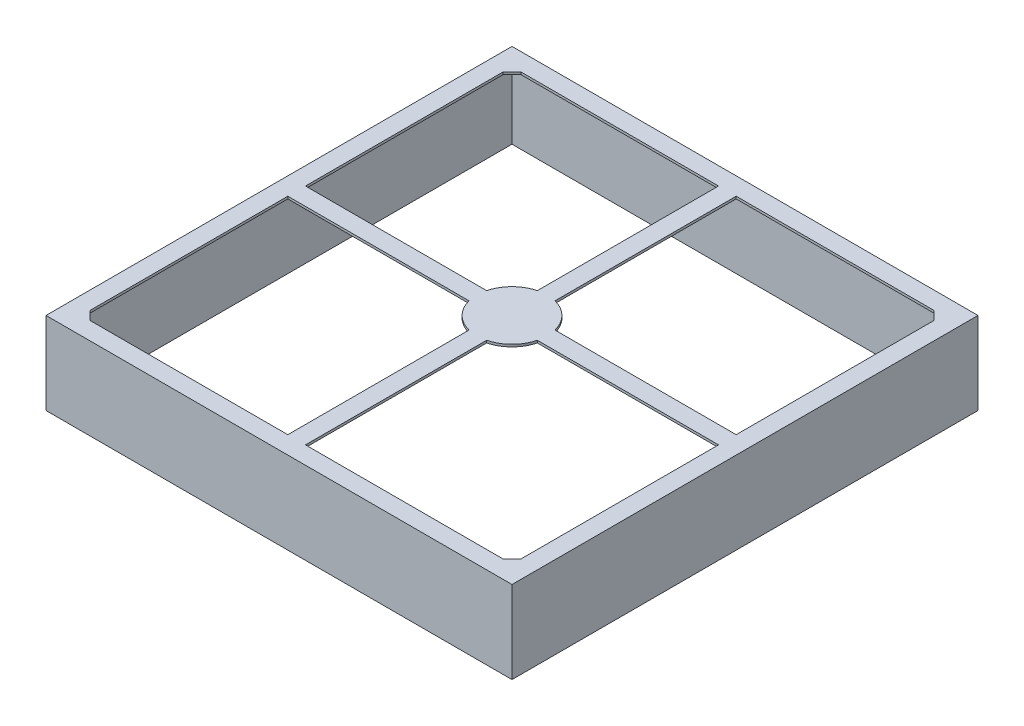
ISO-10303-21;
HEADER;
FILE_DESCRIPTION(('STEP AP214'),'2;1');
FILE_NAME('part.step','',(''),(''),'','','');
FILE_SCHEMA(('AUTOMOTIVE_DESIGN { 1 0 10303 214 1 1 1 1 }'));
ENDSEC;
DATA;
#1=APPLICATION_CONTEXT('core data for automotive mechanical design processes');
#2=APPLICATION_PROTOCOL_DEFINITION('international standard','automotive_design',2000,#1);
#3=PRODUCT_CONTEXT('',#1,'mechanical');
#4=PRODUCT('Part','Part','',(#3));
#5=PRODUCT_RELATED_PRODUCT_CATEGORY('part','',(#4));
#6=PRODUCT_DEFINITION_FORMATION('','',#4);
#7=PRODUCT_DEFINITION_CONTEXT('part definition',#1,'design');
#8=PRODUCT_DEFINITION('design','',#6,#7);
#9=PRODUCT_DEFINITION_SHAPE('','',#8);
#10=(LENGTH_UNIT() NAMED_UNIT(*) SI_UNIT(.MILLI.,.METRE.));
#11=(NAMED_UNIT(*) PLANE_ANGLE_UNIT() SI_UNIT($,.RADIAN.));
#12=(NAMED_UNIT(*) SI_UNIT($,.STERADIAN.) SOLID_ANGLE_UNIT());
#13=UNCERTAINTY_MEASURE_WITH_UNIT(LENGTH_MEASURE(1.E-05),#10,'distance_accuracy_value','');
#14=(GEOMETRIC_REPRESENTATION_CONTEXT(3) GLOBAL_UNCERTAINTY_ASSIGNED_CONTEXT((#13)) GLOBAL_UNIT_ASSIGNED_CONTEXT((#10,
#11,#12)) REPRESENTATION_CONTEXT('',''));
#15=CARTESIAN_POINT('',(0.,0.,0.));
#16=DIRECTION('',(0.,0.,1.));
#17=DIRECTION('',(1.,0.,0.));
#18=AXIS2_PLACEMENT_3D('',#15,#16,#17);
#19=CARTESIAN_POINT('',(19.8,7.,-19.8));
#20=DIRECTION('',(0.,-1.,0.));
#21=DIRECTION('',(0.,0.,-1.));
#22=AXIS2_PLACEMENT_3D('',#19,#20,#21);
#23=PLANE('',#22);
#24=DIRECTION('',(0.,0.,-1.));
#25=VECTOR('',#24,1.);
#26=CARTESIAN_POINT('',(18.3,7.,-0.75));
#27=LINE('',#26,#25);
#28=CARTESIAN_POINT('',(18.3,7.,-0.75));
#29=VERTEX_POINT('',#28);
#30=CARTESIAN_POINT('',(18.3,7.,-17.55));
#31=VERTEX_POINT('',#30);
#32=EDGE_CURVE('E259',#29,#31,#27,.T.);
#33=ORIENTED_EDGE('',*,*,#32,.F.);
#34=DIRECTION('',(1.,0.,0.));
#35=VECTOR('',#34,1.);
#36=CARTESIAN_POINT('',(18.3,7.,-0.75));
#37=LINE('',#36,#35);
#38=CARTESIAN_POINT('',(2.90473750965556,7.,-0.749999999999999));
#39=VERTEX_POINT('',#38);
#40=EDGE_CURVE('E293',#39,#29,#37,.T.);
#41=ORIENTED_EDGE('',*,*,#40,.F.);
#42=CARTESIAN_POINT('',(0.,7.,0.));
#43=DIRECTION('',(0.,-1.,0.));
#44=DIRECTION('',(0.,0.,1.));
#45=AXIS2_PLACEMENT_3D('',#42,#43,#44);
#46=CIRCLE('',#45,3.);
#47=CARTESIAN_POINT('',(0.75,7.,-2.90473750965557));
#48=VERTEX_POINT('',#47);
#49=EDGE_CURVE('E290',#48,#39,#46,.T.);
#50=ORIENTED_EDGE('',*,*,#49,.F.);
#51=DIRECTION('',(0.,0.,1.));
#52=VECTOR('',#51,1.);
#53=CARTESIAN_POINT('',(0.75,7.,-18.3));
#54=LINE('',#53,#52);
#55=CARTESIAN_POINT('',(0.75,7.,-18.3));
#56=VERTEX_POINT('',#55);
#57=EDGE_CURVE('E288',#56,#48,#54,.T.);
#58=ORIENTED_EDGE('',*,*,#57,.F.);
#59=DIRECTION('',(-1.,0.,0.));
#60=VECTOR('',#59,1.);
#61=CARTESIAN_POINT('',(17.55,7.,-18.3));
#62=LINE('',#61,#60);
#63=CARTESIAN_POINT('',(17.55,7.,-18.3));
#64=VERTEX_POINT('',#63);
#65=EDGE_CURVE('E286',#64,#56,#62,.T.);
#66=ORIENTED_EDGE('',*,*,#65,.F.);
#67=DIRECTION('',(-0.707106781186547,0.,-0.707106781186547));
#68=VECTOR('',#67,1.);
#69=CARTESIAN_POINT('',(18.3,7.,-17.55));
#70=LINE('',#69,#68);
#71=EDGE_CURVE('E284',#31,#64,#70,.T.);
#72=ORIENTED_EDGE('',*,*,#71,.F.);
#73=EDGE_LOOP('',(#33,#41,#50,#58,#66,#72));
#74=FACE_BOUND('',#73,.T.);
#75=CARTESIAN_POINT('',(0.,7.,0.));
#76=DIRECTION('',(0.,-1.,0.));
#77=DIRECTION('',(0.,0.,1.));
#78=AXIS2_PLACEMENT_3D('',#75,#76,#77);
#79=CIRCLE('',#78,3.);
#80=CARTESIAN_POINT('',(-0.75,7.,2.90473750965556));
#81=VERTEX_POINT('',#80);
#82=CARTESIAN_POINT('',(-2.90473750965557,7.,0.75));
#83=VERTEX_POINT('',#82);
#84=EDGE_CURVE('E342',#81,#83,#79,.T.);
#85=ORIENTED_EDGE('',*,*,#84,.F.);
#86=DIRECTION('',(0.,0.,-1.));
#87=VECTOR('',#86,1.);
#88=CARTESIAN_POINT('',(-0.75,7.,2.90473750965556));
#89=LINE('',#88,#87);
#90=CARTESIAN_POINT('',(-0.750000000000001,7.,18.3));
#91=VERTEX_POINT('',#90);
#92=EDGE_CURVE('E353',#91,#81,#89,.T.);
#93=ORIENTED_EDGE('',*,*,#92,.F.);
#94=DIRECTION('',(1.,0.,0.));
#95=VECTOR('',#94,1.);
#96=CARTESIAN_POINT('',(-0.75,7.,18.3));
#97=LINE('',#96,#95);
#98=CARTESIAN_POINT('',(-17.55,7.,18.3));
#99=VERTEX_POINT('',#98);
#100=EDGE_CURVE('E350',#99,#91,#97,.T.);
#101=ORIENTED_EDGE('',*,*,#100,.F.);
#102=DIRECTION('',(0.707106781186547,0.,0.707106781186547));
#103=VECTOR('',#102,1.);
#104=CARTESIAN_POINT('',(-17.55,7.,18.3));
#105=LINE('',#104,#103);
#106=CARTESIAN_POINT('',(-18.3,7.,17.55));
#107=VERTEX_POINT('',#106);
#108=EDGE_CURVE('E348',#107,#99,#105,.T.);
#109=ORIENTED_EDGE('',*,*,#108,.F.);
#110=DIRECTION('',(0.,0.,1.));
#111=VECTOR('',#110,1.);
#112=CARTESIAN_POINT('',(-18.3,7.,17.55));
#113=LINE('',#112,#111);
#114=CARTESIAN_POINT('',(-18.3,7.,0.75));
#115=VERTEX_POINT('',#114);
#116=EDGE_CURVE('E346',#115,#107,#113,.T.);
#117=ORIENTED_EDGE('',*,*,#116,.F.);
#118=DIRECTION('',(-1.,0.,0.));
#119=VECTOR('',#118,1.);
#120=CARTESIAN_POINT('',(-2.90473750965557,7.,0.75));
#121=LINE('',#120,#119);
#122=EDGE_CURVE('E344',#83,#115,#121,.T.);
#123=ORIENTED_EDGE('',*,*,#122,.F.);
#124=EDGE_LOOP('',(#85,#93,#101,#109,#117,#123));
#125=FACE_BOUND('',#124,.T.);
#126=DIRECTION('',(0.,0.,-1.));
#127=VECTOR('',#126,1.);
#128=CARTESIAN_POINT('',(19.8,7.,19.8));
#129=LINE('',#128,#127);
#130=CARTESIAN_POINT('',(19.8,7.,19.8));
#131=VERTEX_POINT('',#130);
#132=CARTESIAN_POINT('',(19.8,7.,-19.8));
#133=VERTEX_POINT('',#132);
#134=EDGE_CURVE('E405',#131,#133,#129,.T.);
#135=ORIENTED_EDGE('',*,*,#134,.T.);
#136=DIRECTION('',(-1.,0.,0.));
#137=VECTOR('',#136,1.);
#138=CARTESIAN_POINT('',(-19.8,7.,-19.8));
#139=LINE('',#138,#137);
#140=CARTESIAN_POINT('',(-19.8,7.,-19.8));
#141=VERTEX_POINT('',#140);
#142=EDGE_CURVE('E408',#133,#141,#139,.T.);
#143=ORIENTED_EDGE('',*,*,#142,.T.);
#144=DIRECTION('',(0.,0.,1.));
#145=VECTOR('',#144,1.);
#146=CARTESIAN_POINT('',(-19.8,7.,19.8));
#147=LINE('',#146,#145);
#148=CARTESIAN_POINT('',(-19.8,7.,19.8));
#149=VERTEX_POINT('',#148);
#150=EDGE_CURVE('E411',#141,#149,#147,.T.);
#151=ORIENTED_EDGE('',*,*,#150,.T.);
#152=DIRECTION('',(1.,0.,0.));
#153=VECTOR('',#152,1.);
#154=CARTESIAN_POINT('',(-19.8,7.,19.8));
#155=LINE('',#154,#153);
#156=EDGE_CURVE('E413',#149,#131,#155,.T.);
#157=ORIENTED_EDGE('',*,*,#156,.T.);
#158=EDGE_LOOP('',(#135,#143,#151,#157));
#159=FACE_BOUND('',#158,.T.);
#160=DIRECTION('',(-1.,0.,0.));
#161=VECTOR('',#160,1.);
#162=CARTESIAN_POINT('',(-0.75,7.,-18.3));
#163=LINE('',#162,#161);
#164=CARTESIAN_POINT('',(-0.75,7.,-18.3));
#165=VERTEX_POINT('',#164);
#166=CARTESIAN_POINT('',(-17.55,7.,-18.3));
#167=VERTEX_POINT('',#166);
#168=EDGE_CURVE('E312',#165,#167,#163,.T.);
#169=ORIENTED_EDGE('',*,*,#168,.F.);
#170=DIRECTION('',(0.,0.,-1.));
#171=VECTOR('',#170,1.);
#172=CARTESIAN_POINT('',(-0.75,7.,-18.3));
#173=LINE('',#172,#171);
#174=CARTESIAN_POINT('',(-0.749999999999998,7.,-2.90473750965557));
#175=VERTEX_POINT('',#174);
#176=EDGE_CURVE('E323',#175,#165,#173,.T.);
#177=ORIENTED_EDGE('',*,*,#176,.F.);
#178=CARTESIAN_POINT('',(0.,7.,0.));
#179=DIRECTION('',(0.,-1.,0.));
#180=DIRECTION('',(0.,0.,1.));
#181=AXIS2_PLACEMENT_3D('',#178,#179,#180);
#182=CIRCLE('',#181,3.);
#183=CARTESIAN_POINT('',(-2.90473750965557,7.,-0.750000000000002));
#184=VERTEX_POINT('',#183);
#185=EDGE_CURVE('E320',#184,#175,#182,.T.);
#186=ORIENTED_EDGE('',*,*,#185,.F.);
#187=DIRECTION('',(1.,0.,0.));
#188=VECTOR('',#187,1.);
#189=CARTESIAN_POINT('',(-2.90473750965557,7.,-0.75));
#190=LINE('',#189,#188);
#191=CARTESIAN_POINT('',(-18.3,7.,-0.75));
#192=VERTEX_POINT('',#191);
#193=EDGE_CURVE('E318',#192,#184,#190,.T.);
#194=ORIENTED_EDGE('',*,*,#193,.F.);
#195=DIRECTION('',(0.,0.,1.));
#196=VECTOR('',#195,1.);
#197=CARTESIAN_POINT('',(-18.3,7.,-0.75));
#198=LINE('',#197,#196);
#199=CARTESIAN_POINT('',(-18.3,7.,-17.55));
#200=VERTEX_POINT('',#199);
#201=EDGE_CURVE('E316',#200,#192,#198,.T.);
#202=ORIENTED_EDGE('',*,*,#201,.F.);
#203=DIRECTION('',(-0.707106781186547,0.,0.707106781186547));
#204=VECTOR('',#203,1.);
#205=CARTESIAN_POINT('',(-17.55,7.,-18.3));
#206=LINE('',#205,#204);
#207=EDGE_CURVE('E314',#167,#200,#206,.T.);
#208=ORIENTED_EDGE('',*,*,#207,.F.);
#209=EDGE_LOOP('',(#169,#177,#186,#194,#202,#208));
#210=FACE_BOUND('',#209,.T.);
#211=DIRECTION('',(0.,0.,1.));
#212=VECTOR('',#211,1.);
#213=CARTESIAN_POINT('',(0.75,7.,2.90473750965556));
#214=LINE('',#213,#212);
#215=CARTESIAN_POINT('',(0.75,7.,2.90473750965556));
#216=VERTEX_POINT('',#215);
#217=CARTESIAN_POINT('',(0.75,7.,18.3));
#218=VERTEX_POINT('',#217);
#219=EDGE_CURVE('E245',#216,#218,#214,.T.);
#220=ORIENTED_EDGE('',*,*,#219,.F.);
#221=CARTESIAN_POINT('',(0.,7.,0.));
#222=DIRECTION('',(0.,-1.,0.));
#223=DIRECTION('',(0.,0.,1.));
#224=AXIS2_PLACEMENT_3D('',#221,#222,#223);
#225=CIRCLE('',#224,3.);
#226=CARTESIAN_POINT('',(2.90473750965556,7.,0.749999999999999));
#227=VERTEX_POINT('',#226);
#228=EDGE_CURVE('E272',#227,#216,#225,.T.);
#229=ORIENTED_EDGE('',*,*,#228,.F.);
#230=DIRECTION('',(-1.,0.,0.));
#231=VECTOR('',#230,1.);
#232=CARTESIAN_POINT('',(18.3,7.,0.75));
#233=LINE('',#232,#231);
#234=CARTESIAN_POINT('',(18.3,7.,0.75));
#235=VERTEX_POINT('',#234);
#236=EDGE_CURVE('E270',#235,#227,#233,.T.);
#237=ORIENTED_EDGE('',*,*,#236,.F.);
#238=DIRECTION('',(0.,0.,-1.));
#239=VECTOR('',#238,1.);
#240=CARTESIAN_POINT('',(18.3,7.,17.55));
#241=LINE('',#240,#239);
#242=CARTESIAN_POINT('',(18.3,7.,17.55));
#243=VERTEX_POINT('',#242);
#244=EDGE_CURVE('E266',#243,#235,#241,.T.);
#245=ORIENTED_EDGE('',*,*,#244,.F.);
#246=DIRECTION('',(0.707106781186547,0.,-0.707106781186547));
#247=VECTOR('',#246,1.);
#248=CARTESIAN_POINT('',(17.55,7.,18.3));
#249=LINE('',#248,#247);
#250=CARTESIAN_POINT('',(17.55,7.,18.3));
#251=VERTEX_POINT('',#250);
#252=EDGE_CURVE('E264',#251,#243,#249,.T.);
#253=ORIENTED_EDGE('',*,*,#252,.F.);
#254=DIRECTION('',(1.,0.,0.));
#255=VECTOR('',#254,1.);
#256=CARTESIAN_POINT('',(17.55,7.,18.3));
#257=LINE('',#256,#255);
#258=EDGE_CURVE('E252',#218,#251,#257,.T.);
#259=ORIENTED_EDGE('',*,*,#258,.F.);
#260=EDGE_LOOP('',(#220,#229,#237,#245,#253,#259));
#261=FACE_BOUND('',#260,.T.);
#262=ADVANCED_FACE('F37',(#74,#125,#159,#210,#261),#23,.F.);
#263=CARTESIAN_POINT('',(19.8,6.8,-19.8));
#264=DIRECTION('',(0.,-1.,0.));
#265=DIRECTION('',(0.,0.,-1.));
#266=AXIS2_PLACEMENT_3D('',#263,#264,#265);
#267=PLANE('',#266);
#268=DIRECTION('',(1.,0.,0.));
#269=VECTOR('',#268,1.);
#270=CARTESIAN_POINT('',(19.8,6.8,-0.750000000000001));
#271=LINE('',#270,#269);
#272=CARTESIAN_POINT('',(2.90473750965556,6.8,-0.749999999999999));
#273=VERTEX_POINT('',#272);
#274=CARTESIAN_POINT('',(18.3,6.8,-0.750000000000001));
#275=VERTEX_POINT('',#274);
#276=EDGE_CURVE('E471',#273,#275,#271,.T.);
#277=ORIENTED_EDGE('',*,*,#276,.T.);
#278=DIRECTION('',(0.,0.,-1.));
#279=VECTOR('',#278,1.);
#280=CARTESIAN_POINT('',(18.3,6.8,-19.8));
#281=LINE('',#280,#279);
#282=CARTESIAN_POINT('',(18.3,6.8,-17.55));
#283=VERTEX_POINT('',#282);
#284=EDGE_CURVE('E486',#275,#283,#281,.T.);
#285=ORIENTED_EDGE('',*,*,#284,.T.);
#286=DIRECTION('',(-0.707106781186548,0.,-0.707106781186548));
#287=VECTOR('',#286,1.);
#288=CARTESIAN_POINT('',(17.925,6.8,-17.925));
#289=LINE('',#288,#287);
#290=CARTESIAN_POINT('',(17.55,6.8,-18.3));
#291=VERTEX_POINT('',#290);
#292=EDGE_CURVE('E483',#283,#291,#289,.T.);
#293=ORIENTED_EDGE('',*,*,#292,.T.);
#294=DIRECTION('',(-1.,0.,0.));
#295=VECTOR('',#294,1.);
#296=CARTESIAN_POINT('',(19.8,6.8,-18.3));
#297=LINE('',#296,#295);
#298=CARTESIAN_POINT('',(0.75,6.8,-18.3));
#299=VERTEX_POINT('',#298);
#300=EDGE_CURVE('E480',#291,#299,#297,.T.);
#301=ORIENTED_EDGE('',*,*,#300,.T.);
#302=DIRECTION('',(0.,0.,1.));
#303=VECTOR('',#302,1.);
#304=CARTESIAN_POINT('',(0.750000000000001,6.8,-19.8));
#305=LINE('',#304,#303);
#306=CARTESIAN_POINT('',(0.75,6.8,-2.90473750965557));
#307=VERTEX_POINT('',#306);
#308=EDGE_CURVE('E477',#299,#307,#305,.T.);
#309=ORIENTED_EDGE('',*,*,#308,.T.);
#310=CARTESIAN_POINT('',(0.,6.8,0.));
#311=DIRECTION('',(0.,-1.,0.));
#312=DIRECTION('',(0.,0.,-1.));
#313=AXIS2_PLACEMENT_3D('',#310,#311,#312);
#314=CIRCLE('',#313,3.);
#315=EDGE_CURVE('E474',#307,#273,#314,.T.);
#316=ORIENTED_EDGE('',*,*,#315,.T.);
#317=EDGE_LOOP('',(#277,#285,#293,#301,#309,#316));
#318=FACE_BOUND('',#317,.T.);
#319=DIRECTION('',(0.,0.,-1.));
#320=VECTOR('',#319,1.);
#321=CARTESIAN_POINT('',(-0.750000000000001,6.8,-19.8));
#322=LINE('',#321,#320);
#323=CARTESIAN_POINT('',(-0.75,6.8,18.3));
#324=VERTEX_POINT('',#323);
#325=CARTESIAN_POINT('',(-0.750000000000001,6.8,2.90473750965556));
#326=VERTEX_POINT('',#325);
#327=EDGE_CURVE('E435',#324,#326,#322,.T.);
#328=ORIENTED_EDGE('',*,*,#327,.T.);
#329=CARTESIAN_POINT('',(0.,6.8,0.));
#330=DIRECTION('',(0.,-1.,0.));
#331=DIRECTION('',(0.,0.,-1.));
#332=AXIS2_PLACEMENT_3D('',#329,#330,#331);
#333=CIRCLE('',#332,3.);
#334=CARTESIAN_POINT('',(-2.90473750965557,6.8,0.75));
#335=VERTEX_POINT('',#334);
#336=EDGE_CURVE('E450',#326,#335,#333,.T.);
#337=ORIENTED_EDGE('',*,*,#336,.T.);
#338=DIRECTION('',(-1.,0.,0.));
#339=VECTOR('',#338,1.);
#340=CARTESIAN_POINT('',(19.8,6.8,0.750000000000001));
#341=LINE('',#340,#339);
#342=CARTESIAN_POINT('',(-18.3,6.8,0.75));
#343=VERTEX_POINT('',#342);
#344=EDGE_CURVE('E447',#335,#343,#341,.T.);
#345=ORIENTED_EDGE('',*,*,#344,.T.);
#346=DIRECTION('',(0.,0.,1.));
#347=VECTOR('',#346,1.);
#348=CARTESIAN_POINT('',(-18.3,6.8,-19.8));
#349=LINE('',#348,#347);
#350=CARTESIAN_POINT('',(-18.3,6.8,17.55));
#351=VERTEX_POINT('',#350);
#352=EDGE_CURVE('E444',#343,#351,#349,.T.);
#353=ORIENTED_EDGE('',*,*,#352,.T.);
#354=DIRECTION('',(0.707106781186548,0.,0.707106781186548));
#355=VECTOR('',#354,1.);
#356=CARTESIAN_POINT('',(-17.925,6.8,17.925));
#357=LINE('',#356,#355);
#358=CARTESIAN_POINT('',(-17.55,6.8,18.3));
#359=VERTEX_POINT('',#358);
#360=EDGE_CURVE('E441',#351,#359,#357,.T.);
#361=ORIENTED_EDGE('',*,*,#360,.T.);
#362=DIRECTION('',(1.,0.,0.));
#363=VECTOR('',#362,1.);
#364=CARTESIAN_POINT('',(19.8,6.8,18.3));
#365=LINE('',#364,#363);
#366=EDGE_CURVE('E438',#359,#324,#365,.T.);
#367=ORIENTED_EDGE('',*,*,#366,.T.);
#368=EDGE_LOOP('',(#328,#337,#345,#353,#361,#367));
#369=FACE_BOUND('',#368,.T.);
#370=DIRECTION('',(0.,0.,-1.));
#371=VECTOR('',#370,1.);
#372=CARTESIAN_POINT('',(19.6,6.8,-19.8));
#373=LINE('',#372,#371);
#374=CARTESIAN_POINT('',(19.6,6.8,19.6));
#375=VERTEX_POINT('',#374);
#376=CARTESIAN_POINT('',(19.6,6.8,-19.6));
#377=VERTEX_POINT('',#376);
#378=EDGE_CURVE('E378',#375,#377,#373,.T.);
#379=ORIENTED_EDGE('',*,*,#378,.F.);
#380=DIRECTION('',(1.,0.,0.));
#381=VECTOR('',#380,1.);
#382=CARTESIAN_POINT('',(19.8,6.8,19.6));
#383=LINE('',#382,#381);
#384=CARTESIAN_POINT('',(-19.6,6.8,19.6));
#385=VERTEX_POINT('',#384);
#386=EDGE_CURVE('E386',#385,#375,#383,.T.);
#387=ORIENTED_EDGE('',*,*,#386,.F.);
#388=DIRECTION('',(0.,0.,1.));
#389=VECTOR('',#388,1.);
#390=CARTESIAN_POINT('',(-19.6,6.8,-19.8));
#391=LINE('',#390,#389);
#392=CARTESIAN_POINT('',(-19.6,6.8,-19.6));
#393=VERTEX_POINT('',#392);
#394=EDGE_CURVE('E390',#393,#385,#391,.T.);
#395=ORIENTED_EDGE('',*,*,#394,.F.);
#396=DIRECTION('',(-1.,0.,0.));
#397=VECTOR('',#396,1.);
#398=CARTESIAN_POINT('',(19.8,6.8,-19.6));
#399=LINE('',#398,#397);
#400=EDGE_CURVE('E381',#377,#393,#399,.T.);
#401=ORIENTED_EDGE('',*,*,#400,.F.);
#402=EDGE_LOOP('',(#379,#387,#395,#401));
#403=FACE_BOUND('',#402,.T.);
#404=DIRECTION('',(0.,0.,-1.));
#405=VECTOR('',#404,1.);
#406=CARTESIAN_POINT('',(-0.750000000000001,6.8,-19.8));
#407=LINE('',#406,#405);
#408=CARTESIAN_POINT('',(-0.749999999999998,6.8,-2.90473750965557));
#409=VERTEX_POINT('',#408);
#410=CARTESIAN_POINT('',(-0.75,6.8,-18.3));
#411=VERTEX_POINT('',#410);
#412=EDGE_CURVE('E453',#409,#411,#407,.T.);
#413=ORIENTED_EDGE('',*,*,#412,.T.);
#414=DIRECTION('',(-1.,0.,0.));
#415=VECTOR('',#414,1.);
#416=CARTESIAN_POINT('',(19.8,6.8,-18.3));
#417=LINE('',#416,#415);
#418=CARTESIAN_POINT('',(-17.55,6.8,-18.3));
#419=VERTEX_POINT('',#418);
#420=EDGE_CURVE('E468',#411,#419,#417,.T.);
#421=ORIENTED_EDGE('',*,*,#420,.T.);
#422=DIRECTION('',(-0.707106781186548,0.,0.707106781186548));
#423=VECTOR('',#422,1.);
#424=CARTESIAN_POINT('',(1.87499999999999,6.8,-37.725));
#425=LINE('',#424,#423);
#426=CARTESIAN_POINT('',(-18.3,6.8,-17.55));
#427=VERTEX_POINT('',#426);
#428=EDGE_CURVE('E465',#419,#427,#425,.T.);
#429=ORIENTED_EDGE('',*,*,#428,.T.);
#430=DIRECTION('',(0.,0.,1.));
#431=VECTOR('',#430,1.);
#432=CARTESIAN_POINT('',(-18.3,6.8,-19.8));
#433=LINE('',#432,#431);
#434=CARTESIAN_POINT('',(-18.3,6.8,-0.75));
#435=VERTEX_POINT('',#434);
#436=EDGE_CURVE('E462',#427,#435,#433,.T.);
#437=ORIENTED_EDGE('',*,*,#436,.T.);
#438=DIRECTION('',(1.,0.,0.));
#439=VECTOR('',#438,1.);
#440=CARTESIAN_POINT('',(19.8,6.8,-0.750000000000001));
#441=LINE('',#440,#439);
#442=CARTESIAN_POINT('',(-2.90473750965557,6.8,-0.750000000000002));
#443=VERTEX_POINT('',#442);
#444=EDGE_CURVE('E459',#435,#443,#441,.T.);
#445=ORIENTED_EDGE('',*,*,#444,.T.);
#446=CARTESIAN_POINT('',(0.,6.8,0.));
#447=DIRECTION('',(0.,-1.,0.));
#448=DIRECTION('',(0.,0.,-1.));
#449=AXIS2_PLACEMENT_3D('',#446,#447,#448);
#450=CIRCLE('',#449,3.);
#451=EDGE_CURVE('E456',#443,#409,#450,.T.);
#452=ORIENTED_EDGE('',*,*,#451,.T.);
#453=EDGE_LOOP('',(#413,#421,#429,#437,#445,#452));
#454=FACE_BOUND('',#453,.T.);
#455=CARTESIAN_POINT('',(0.,6.8,0.));
#456=DIRECTION('',(0.,-1.,0.));
#457=DIRECTION('',(0.,0.,-1.));
#458=AXIS2_PLACEMENT_3D('',#455,#456,#457);
#459=CIRCLE('',#458,3.);
#460=CARTESIAN_POINT('',(2.90473750965556,6.8,0.749999999999999));
#461=VERTEX_POINT('',#460);
#462=CARTESIAN_POINT('',(0.75,6.8,2.90473750965556));
#463=VERTEX_POINT('',#462);
#464=EDGE_CURVE('E489',#461,#463,#459,.T.);
#465=ORIENTED_EDGE('',*,*,#464,.T.);
#466=DIRECTION('',(0.,0.,1.));
#467=VECTOR('',#466,1.);
#468=CARTESIAN_POINT('',(0.750000000000001,6.8,-19.8));
#469=LINE('',#468,#467);
#470=CARTESIAN_POINT('',(0.75,6.8,18.3));
#471=VERTEX_POINT('',#470);
#472=EDGE_CURVE('E11',#463,#471,#469,.T.);
#473=ORIENTED_EDGE('',*,*,#472,.T.);
#474=DIRECTION('',(1.,0.,0.));
#475=VECTOR('',#474,1.);
#476=CARTESIAN_POINT('',(19.8,6.8,18.3));
#477=LINE('',#476,#475);
#478=CARTESIAN_POINT('',(17.55,6.8,18.3));
#479=VERTEX_POINT('',#478);
#480=EDGE_CURVE('E45',#471,#479,#477,.T.);
#481=ORIENTED_EDGE('',*,*,#480,.T.);
#482=DIRECTION('',(0.707106781186548,0.,-0.707106781186548));
#483=VECTOR('',#482,1.);
#484=CARTESIAN_POINT('',(37.725,6.8,-1.875));
#485=LINE('',#484,#483);
#486=CARTESIAN_POINT('',(18.3,6.8,17.55));
#487=VERTEX_POINT('',#486);
#488=EDGE_CURVE('E498',#479,#487,#485,.T.);
#489=ORIENTED_EDGE('',*,*,#488,.T.);
#490=DIRECTION('',(0.,0.,-1.));
#491=VECTOR('',#490,1.);
#492=CARTESIAN_POINT('',(18.3,6.8,-19.8));
#493=LINE('',#492,#491);
#494=CARTESIAN_POINT('',(18.3,6.8,0.75));
#495=VERTEX_POINT('',#494);
#496=EDGE_CURVE('E495',#487,#495,#493,.T.);
#497=ORIENTED_EDGE('',*,*,#496,.T.);
#498=DIRECTION('',(-1.,0.,0.));
#499=VECTOR('',#498,1.);
#500=CARTESIAN_POINT('',(19.8,6.8,0.750000000000001));
#501=LINE('',#500,#499);
#502=EDGE_CURVE('E492',#495,#461,#501,.T.);
#503=ORIENTED_EDGE('',*,*,#502,.T.);
#504=EDGE_LOOP('',(#465,#473,#481,#489,#497,#503));
#505=FACE_BOUND('',#504,.T.);
#506=ADVANCED_FACE('F501',(#318,#369,#403,#454,#505),#267,.T.);
#507=CARTESIAN_POINT('',(19.8,0.,-19.8));
#508=DIRECTION('',(0.,-1.,0.));
#509=DIRECTION('',(0.,0.,-1.));
#510=AXIS2_PLACEMENT_3D('',#507,#508,#509);
#511=PLANE('',#510);
#512=DIRECTION('',(0.,0.,-1.));
#513=VECTOR('',#512,1.);
#514=CARTESIAN_POINT('',(19.8,0.,19.8));
#515=LINE('',#514,#513);
#516=CARTESIAN_POINT('',(19.8,0.,19.8));
#517=VERTEX_POINT('',#516);
#518=CARTESIAN_POINT('',(19.8,0.,-19.8));
#519=VERTEX_POINT('',#518);
#520=EDGE_CURVE('E376',#517,#519,#515,.T.);
#521=ORIENTED_EDGE('',*,*,#520,.F.);
#522=DIRECTION('',(1.,0.,0.));
#523=VECTOR('',#522,1.);
#524=CARTESIAN_POINT('',(-19.8,0.,19.8));
#525=LINE('',#524,#523);
#526=CARTESIAN_POINT('',(-19.8,0.,19.8));
#527=VERTEX_POINT('',#526);
#528=EDGE_CURVE('E409',#527,#517,#525,.T.);
#529=ORIENTED_EDGE('',*,*,#528,.F.);
#530=DIRECTION('',(0.,0.,1.));
#531=VECTOR('',#530,1.);
#532=CARTESIAN_POINT('',(-19.8,0.,19.8));
#533=LINE('',#532,#531);
#534=CARTESIAN_POINT('',(-19.8,0.,-19.8));
#535=VERTEX_POINT('',#534);
#536=EDGE_CURVE('E421',#535,#527,#533,.T.);
#537=ORIENTED_EDGE('',*,*,#536,.F.);
#538=DIRECTION('',(-1.,0.,0.));
#539=VECTOR('',#538,1.);
#540=CARTESIAN_POINT('',(-19.8,0.,-19.8));
#541=LINE('',#540,#539);
#542=EDGE_CURVE('E419',#519,#535,#541,.T.);
#543=ORIENTED_EDGE('',*,*,#542,.F.);
#544=EDGE_LOOP('',(#521,#529,#537,#543));
#545=FACE_BOUND('',#544,.T.);
#546=DIRECTION('',(1.,0.,0.));
#547=VECTOR('',#546,1.);
#548=CARTESIAN_POINT('',(19.8,0.,19.6));
#549=LINE('',#548,#547);
#550=CARTESIAN_POINT('',(-19.6,0.,19.6));
#551=VERTEX_POINT('',#550);
#552=CARTESIAN_POINT('',(19.6,0.,19.6));
#553=VERTEX_POINT('',#552);
#554=EDGE_CURVE('E382',#551,#553,#549,.T.);
#555=ORIENTED_EDGE('',*,*,#554,.T.);
#556=DIRECTION('',(0.,0.,-1.));
#557=VECTOR('',#556,1.);
#558=CARTESIAN_POINT('',(19.6,0.,-19.8));
#559=LINE('',#558,#557);
#560=CARTESIAN_POINT('',(19.6,0.,-19.6));
#561=VERTEX_POINT('',#560);
#562=EDGE_CURVE('E372',#553,#561,#559,.T.);
#563=ORIENTED_EDGE('',*,*,#562,.T.);
#564=DIRECTION('',(-1.,0.,0.));
#565=VECTOR('',#564,1.);
#566=CARTESIAN_POINT('',(19.8,0.,-19.6));
#567=LINE('',#566,#565);
#568=CARTESIAN_POINT('',(-19.6,0.,-19.6));
#569=VERTEX_POINT('',#568);
#570=EDGE_CURVE('E397',#561,#569,#567,.T.);
#571=ORIENTED_EDGE('',*,*,#570,.T.);
#572=DIRECTION('',(0.,0.,1.));
#573=VECTOR('',#572,1.);
#574=CARTESIAN_POINT('',(-19.6,0.,-19.8));
#575=LINE('',#574,#573);
#576=EDGE_CURVE('E400',#569,#551,#575,.T.);
#577=ORIENTED_EDGE('',*,*,#576,.T.);
#578=EDGE_LOOP('',(#555,#563,#571,#577));
#579=FACE_BOUND('',#578,.T.);
#580=ADVANCED_FACE('F526',(#545,#579),#511,.T.);
#581=CARTESIAN_POINT('',(19.8,7.,19.8));
#582=DIRECTION('',(-1.,0.,0.));
#583=DIRECTION('',(0.,0.,1.));
#584=AXIS2_PLACEMENT_3D('',#581,#582,#583);
#585=PLANE('',#584);
#586=ORIENTED_EDGE('',*,*,#520,.T.);
#587=DIRECTION('',(0.,-1.,0.));
#588=VECTOR('',#587,1.);
#589=CARTESIAN_POINT('',(19.8,7.,-19.8));
#590=LINE('',#589,#588);
#591=EDGE_CURVE('E432',#133,#519,#590,.T.);
#592=ORIENTED_EDGE('',*,*,#591,.F.);
#593=ORIENTED_EDGE('',*,*,#134,.F.);
#594=DIRECTION('',(0.,-1.,0.));
#595=VECTOR('',#594,1.);
#596=CARTESIAN_POINT('',(19.8,7.,19.8));
#597=LINE('',#596,#595);
#598=EDGE_CURVE('E415',#131,#517,#597,.T.);
#599=ORIENTED_EDGE('',*,*,#598,.T.);
#600=EDGE_LOOP('',(#586,#592,#593,#599));
#601=FACE_BOUND('',#600,.T.);
#602=ADVANCED_FACE('F39',(#601),#585,.F.);
#603=CARTESIAN_POINT('',(-19.8,7.,-19.8));
#604=DIRECTION('',(0.,0.,1.));
#605=DIRECTION('',(1.,0.,0.));
#606=AXIS2_PLACEMENT_3D('',#603,#604,#605);
#607=PLANE('',#606);
#608=ORIENTED_EDGE('',*,*,#542,.T.);
#609=DIRECTION('',(0.,-1.,0.));
#610=VECTOR('',#609,1.);
#611=CARTESIAN_POINT('',(-19.8,7.,-19.8));
#612=LINE('',#611,#610);
#613=EDGE_CURVE('E429',#141,#535,#612,.T.);
#614=ORIENTED_EDGE('',*,*,#613,.F.);
#615=ORIENTED_EDGE('',*,*,#142,.F.);
#616=ORIENTED_EDGE('',*,*,#591,.T.);
#617=EDGE_LOOP('',(#608,#614,#615,#616));
#618=FACE_BOUND('',#617,.T.);
#619=ADVANCED_FACE('F543',(#618),#607,.F.);
#620=CARTESIAN_POINT('',(-19.8,7.,19.8));
#621=DIRECTION('',(1.,0.,0.));
#622=DIRECTION('',(0.,0.,-1.));
#623=AXIS2_PLACEMENT_3D('',#620,#621,#622);
#624=PLANE('',#623);
#625=ORIENTED_EDGE('',*,*,#536,.T.);
#626=DIRECTION('',(0.,-1.,0.));
#627=VECTOR('',#626,1.);
#628=CARTESIAN_POINT('',(-19.8,7.,19.8));
#629=LINE('',#628,#627);
#630=EDGE_CURVE('E426',#149,#527,#629,.T.);
#631=ORIENTED_EDGE('',*,*,#630,.F.);
#632=ORIENTED_EDGE('',*,*,#150,.F.);
#633=ORIENTED_EDGE('',*,*,#613,.T.);
#634=EDGE_LOOP('',(#625,#631,#632,#633));
#635=FACE_BOUND('',#634,.T.);
#636=ADVANCED_FACE('F540',(#635),#624,.F.);
#637=CARTESIAN_POINT('',(-19.8,7.,19.8));
#638=DIRECTION('',(0.,0.,-1.));
#639=DIRECTION('',(-1.,0.,0.));
#640=AXIS2_PLACEMENT_3D('',#637,#638,#639);
#641=PLANE('',#640);
#642=ORIENTED_EDGE('',*,*,#528,.T.);
#643=ORIENTED_EDGE('',*,*,#598,.F.);
#644=ORIENTED_EDGE('',*,*,#156,.F.);
#645=ORIENTED_EDGE('',*,*,#630,.T.);
#646=EDGE_LOOP('',(#642,#643,#644,#645));
#647=FACE_BOUND('',#646,.T.);
#648=ADVANCED_FACE('F536',(#647),#641,.F.);
#649=CARTESIAN_POINT('',(19.6,7.,19.8));
#650=DIRECTION('',(-1.,0.,0.));
#651=DIRECTION('',(0.,0.,1.));
#652=AXIS2_PLACEMENT_3D('',#649,#650,#651);
#653=PLANE('',#652);
#654=ORIENTED_EDGE('',*,*,#562,.F.);
#655=DIRECTION('',(0.,-1.,0.));
#656=VECTOR('',#655,1.);
#657=CARTESIAN_POINT('',(19.6,7.,19.6));
#658=LINE('',#657,#656);
#659=EDGE_CURVE('E383',#375,#553,#658,.T.);
#660=ORIENTED_EDGE('',*,*,#659,.F.);
#661=ORIENTED_EDGE('',*,*,#378,.T.);
#662=DIRECTION('',(0.,-1.,0.));
#663=VECTOR('',#662,1.);
#664=CARTESIAN_POINT('',(19.6,7.,-19.6));
#665=LINE('',#664,#663);
#666=EDGE_CURVE('E373',#377,#561,#665,.T.);
#667=ORIENTED_EDGE('',*,*,#666,.T.);
#668=EDGE_LOOP('',(#654,#660,#661,#667));
#669=FACE_BOUND('',#668,.T.);
#670=ADVANCED_FACE('F539',(#669),#653,.T.);
#671=CARTESIAN_POINT('',(-19.8,7.,-19.6));
#672=DIRECTION('',(0.,0.,1.));
#673=DIRECTION('',(1.,0.,0.));
#674=AXIS2_PLACEMENT_3D('',#671,#672,#673);
#675=PLANE('',#674);
#676=ORIENTED_EDGE('',*,*,#570,.F.);
#677=ORIENTED_EDGE('',*,*,#666,.F.);
#678=ORIENTED_EDGE('',*,*,#400,.T.);
#679=DIRECTION('',(0.,-1.,0.));
#680=VECTOR('',#679,1.);
#681=CARTESIAN_POINT('',(-19.6,7.,-19.6));
#682=LINE('',#681,#680);
#683=EDGE_CURVE('E377',#393,#569,#682,.T.);
#684=ORIENTED_EDGE('',*,*,#683,.T.);
#685=EDGE_LOOP('',(#676,#677,#678,#684));
#686=FACE_BOUND('',#685,.T.);
#687=ADVANCED_FACE('F628',(#686),#675,.T.);
#688=CARTESIAN_POINT('',(-19.6,7.,19.8));
#689=DIRECTION('',(1.,0.,0.));
#690=DIRECTION('',(0.,0.,-1.));
#691=AXIS2_PLACEMENT_3D('',#688,#689,#690);
#692=PLANE('',#691);
#693=ORIENTED_EDGE('',*,*,#576,.F.);
#694=ORIENTED_EDGE('',*,*,#683,.F.);
#695=ORIENTED_EDGE('',*,*,#394,.T.);
#696=DIRECTION('',(0.,-1.,0.));
#697=VECTOR('',#696,1.);
#698=CARTESIAN_POINT('',(-19.6,7.,19.6));
#699=LINE('',#698,#697);
#700=EDGE_CURVE('E385',#385,#551,#699,.T.);
#701=ORIENTED_EDGE('',*,*,#700,.T.);
#702=EDGE_LOOP('',(#693,#694,#695,#701));
#703=FACE_BOUND('',#702,.T.);
#704=ADVANCED_FACE('F632',(#703),#692,.T.);
#705=CARTESIAN_POINT('',(-19.8,7.,19.6));
#706=DIRECTION('',(0.,0.,-1.));
#707=DIRECTION('',(-1.,0.,0.));
#708=AXIS2_PLACEMENT_3D('',#705,#706,#707);
#709=PLANE('',#708);
#710=ORIENTED_EDGE('',*,*,#554,.F.);
#711=ORIENTED_EDGE('',*,*,#700,.F.);
#712=ORIENTED_EDGE('',*,*,#386,.T.);
#713=ORIENTED_EDGE('',*,*,#659,.T.);
#714=EDGE_LOOP('',(#710,#711,#712,#713));
#715=FACE_BOUND('',#714,.T.);
#716=ADVANCED_FACE('F624',(#715),#709,.T.);
#717=CARTESIAN_POINT('',(0.,7.,0.));
#718=DIRECTION('',(0.,-1.,0.));
#719=DIRECTION('',(0.,0.,-1.));
#720=AXIS2_PLACEMENT_3D('',#717,#718,#719);
#721=CYLINDRICAL_SURFACE('',#720,3.);
#722=DIRECTION('',(0.,-1.,0.));
#723=VECTOR('',#722,1.);
#724=CARTESIAN_POINT('',(-0.75,7.,2.90473750965556));
#725=LINE('',#724,#723);
#726=EDGE_CURVE('E355',#81,#326,#725,.T.);
#727=ORIENTED_EDGE('',*,*,#726,.F.);
#728=ORIENTED_EDGE('',*,*,#84,.T.);
#729=DIRECTION('',(0.,-1.,0.));
#730=VECTOR('',#729,1.);
#731=CARTESIAN_POINT('',(-2.90473750965557,7.,0.75));
#732=LINE('',#731,#730);
#733=EDGE_CURVE('E369',#83,#335,#732,.T.);
#734=ORIENTED_EDGE('',*,*,#733,.T.);
#735=ORIENTED_EDGE('',*,*,#336,.F.);
#736=EDGE_LOOP('',(#727,#728,#734,#735));
#737=FACE_BOUND('',#736,.T.);
#738=ADVANCED_FACE('F620',(#737),#721,.T.);
#739=CARTESIAN_POINT('',(-2.90473750965557,7.,0.75));
#740=DIRECTION('',(0.,0.,1.));
#741=DIRECTION('',(1.,0.,0.));
#742=AXIS2_PLACEMENT_3D('',#739,#740,#741);
#743=PLANE('',#742);
#744=ORIENTED_EDGE('',*,*,#733,.F.);
#745=ORIENTED_EDGE('',*,*,#122,.T.);
#746=DIRECTION('',(0.,-1.,0.));
#747=VECTOR('',#746,1.);
#748=CARTESIAN_POINT('',(-18.3,7.,0.75));
#749=LINE('',#748,#747);
#750=EDGE_CURVE('E366',#115,#343,#749,.T.);
#751=ORIENTED_EDGE('',*,*,#750,.T.);
#752=ORIENTED_EDGE('',*,*,#344,.F.);
#753=EDGE_LOOP('',(#744,#745,#751,#752));
#754=FACE_BOUND('',#753,.T.);
#755=ADVANCED_FACE('F616',(#754),#743,.T.);
#756=CARTESIAN_POINT('',(-18.3,7.,17.55));
#757=DIRECTION('',(1.,0.,0.));
#758=DIRECTION('',(0.,0.,-1.));
#759=AXIS2_PLACEMENT_3D('',#756,#757,#758);
#760=PLANE('',#759);
#761=ORIENTED_EDGE('',*,*,#750,.F.);
#762=ORIENTED_EDGE('',*,*,#116,.T.);
#763=DIRECTION('',(0.,-1.,0.));
#764=VECTOR('',#763,1.);
#765=CARTESIAN_POINT('',(-18.3,7.,17.55));
#766=LINE('',#765,#764);
#767=EDGE_CURVE('E363',#107,#351,#766,.T.);
#768=ORIENTED_EDGE('',*,*,#767,.T.);
#769=ORIENTED_EDGE('',*,*,#352,.F.);
#770=EDGE_LOOP('',(#761,#762,#768,#769));
#771=FACE_BOUND('',#770,.T.);
#772=ADVANCED_FACE('F612',(#771),#760,.T.);
#773=CARTESIAN_POINT('',(-17.55,7.,18.3));
#774=DIRECTION('',(0.707106781186548,0.,-0.707106781186548));
#775=DIRECTION('',(-0.707106781186548,0.,-0.707106781186548));
#776=AXIS2_PLACEMENT_3D('',#773,#774,#775);
#777=PLANE('',#776);
#778=ORIENTED_EDGE('',*,*,#767,.F.);
#779=ORIENTED_EDGE('',*,*,#108,.T.);
#780=DIRECTION('',(0.,-1.,0.));
#781=VECTOR('',#780,1.);
#782=CARTESIAN_POINT('',(-17.55,7.,18.3));
#783=LINE('',#782,#781);
#784=EDGE_CURVE('E360',#99,#359,#783,.T.);
#785=ORIENTED_EDGE('',*,*,#784,.T.);
#786=ORIENTED_EDGE('',*,*,#360,.F.);
#787=EDGE_LOOP('',(#778,#779,#785,#786));
#788=FACE_BOUND('',#787,.T.);
#789=ADVANCED_FACE('F608',(#788),#777,.T.);
#790=CARTESIAN_POINT('',(-0.75,7.,18.3));
#791=DIRECTION('',(0.,0.,-1.));
#792=DIRECTION('',(-1.,0.,0.));
#793=AXIS2_PLACEMENT_3D('',#790,#791,#792);
#794=PLANE('',#793);
#795=ORIENTED_EDGE('',*,*,#784,.F.);
#796=ORIENTED_EDGE('',*,*,#100,.T.);
#797=DIRECTION('',(0.,-1.,0.));
#798=VECTOR('',#797,1.);
#799=CARTESIAN_POINT('',(-0.75,7.,18.3));
#800=LINE('',#799,#798);
#801=EDGE_CURVE('E357',#91,#324,#800,.T.);
#802=ORIENTED_EDGE('',*,*,#801,.T.);
#803=ORIENTED_EDGE('',*,*,#366,.F.);
#804=EDGE_LOOP('',(#795,#796,#802,#803));
#805=FACE_BOUND('',#804,.T.);
#806=ADVANCED_FACE('F604',(#805),#794,.T.);
#807=CARTESIAN_POINT('',(-0.75,7.,2.90473750965556));
#808=DIRECTION('',(-1.,0.,0.));
#809=DIRECTION('',(0.,0.,1.));
#810=AXIS2_PLACEMENT_3D('',#807,#808,#809);
#811=PLANE('',#810);
#812=ORIENTED_EDGE('',*,*,#801,.F.);
#813=ORIENTED_EDGE('',*,*,#92,.T.);
#814=ORIENTED_EDGE('',*,*,#726,.T.);
#815=ORIENTED_EDGE('',*,*,#327,.F.);
#816=EDGE_LOOP('',(#812,#813,#814,#815));
#817=FACE_BOUND('',#816,.T.);
#818=ADVANCED_FACE('F601',(#817),#811,.T.);
#819=CARTESIAN_POINT('',(-0.75,7.,-18.3));
#820=DIRECTION('',(0.,0.,1.));
#821=DIRECTION('',(1.,0.,0.));
#822=AXIS2_PLACEMENT_3D('',#819,#820,#821);
#823=PLANE('',#822);
#824=DIRECTION('',(0.,-1.,0.));
#825=VECTOR('',#824,1.);
#826=CARTESIAN_POINT('',(-0.75,7.,-18.3));
#827=LINE('',#826,#825);
#828=EDGE_CURVE('E325',#165,#411,#827,.T.);
#829=ORIENTED_EDGE('',*,*,#828,.F.);
#830=ORIENTED_EDGE('',*,*,#168,.T.);
#831=DIRECTION('',(0.,-1.,0.));
#832=VECTOR('',#831,1.);
#833=CARTESIAN_POINT('',(-17.55,7.,-18.3));
#834=LINE('',#833,#832);
#835=EDGE_CURVE('E339',#167,#419,#834,.T.);
#836=ORIENTED_EDGE('',*,*,#835,.T.);
#837=ORIENTED_EDGE('',*,*,#420,.F.);
#838=EDGE_LOOP('',(#829,#830,#836,#837));
#839=FACE_BOUND('',#838,.T.);
#840=ADVANCED_FACE('F572',(#839),#823,.T.);
#841=CARTESIAN_POINT('',(-17.55,7.,-18.3));
#842=DIRECTION('',(0.707106781186548,0.,0.707106781186548));
#843=DIRECTION('',(0.707106781186548,0.,-0.707106781186548));
#844=AXIS2_PLACEMENT_3D('',#841,#842,#843);
#845=PLANE('',#844);
#846=ORIENTED_EDGE('',*,*,#835,.F.);
#847=ORIENTED_EDGE('',*,*,#207,.T.);
#848=DIRECTION('',(0.,-1.,0.));
#849=VECTOR('',#848,1.);
#850=CARTESIAN_POINT('',(-18.3,7.,-17.55));
#851=LINE('',#850,#849);
#852=EDGE_CURVE('E336',#200,#427,#851,.T.);
#853=ORIENTED_EDGE('',*,*,#852,.T.);
#854=ORIENTED_EDGE('',*,*,#428,.F.);
#855=EDGE_LOOP('',(#846,#847,#853,#854));
#856=FACE_BOUND('',#855,.T.);
#857=ADVANCED_FACE('F575',(#856),#845,.T.);
#858=CARTESIAN_POINT('',(-18.3,7.,-0.75));
#859=DIRECTION('',(1.,0.,0.));
#860=DIRECTION('',(0.,0.,-1.));
#861=AXIS2_PLACEMENT_3D('',#858,#859,#860);
#862=PLANE('',#861);
#863=ORIENTED_EDGE('',*,*,#852,.F.);
#864=ORIENTED_EDGE('',*,*,#201,.T.);
#865=DIRECTION('',(0.,-1.,0.));
#866=VECTOR('',#865,1.);
#867=CARTESIAN_POINT('',(-18.3,7.,-0.75));
#868=LINE('',#867,#866);
#869=EDGE_CURVE('E333',#192,#435,#868,.T.);
#870=ORIENTED_EDGE('',*,*,#869,.T.);
#871=ORIENTED_EDGE('',*,*,#436,.F.);
#872=EDGE_LOOP('',(#863,#864,#870,#871));
#873=FACE_BOUND('',#872,.T.);
#874=ADVANCED_FACE('F588',(#873),#862,.T.);
#875=CARTESIAN_POINT('',(-2.90473750965557,7.,-0.75));
#876=DIRECTION('',(0.,0.,-1.));
#877=DIRECTION('',(-1.,0.,0.));
#878=AXIS2_PLACEMENT_3D('',#875,#876,#877);
#879=PLANE('',#878);
#880=ORIENTED_EDGE('',*,*,#869,.F.);
#881=ORIENTED_EDGE('',*,*,#193,.T.);
#882=DIRECTION('',(0.,-1.,0.));
#883=VECTOR('',#882,1.);
#884=CARTESIAN_POINT('',(-2.90473750965557,7.,-0.750000000000002));
#885=LINE('',#884,#883);
#886=EDGE_CURVE('E330',#184,#443,#885,.T.);
#887=ORIENTED_EDGE('',*,*,#886,.T.);
#888=ORIENTED_EDGE('',*,*,#444,.F.);
#889=EDGE_LOOP('',(#880,#881,#887,#888));
#890=FACE_BOUND('',#889,.T.);
#891=ADVANCED_FACE('F586',(#890),#879,.T.);
#892=CARTESIAN_POINT('',(0.,7.,0.));
#893=DIRECTION('',(0.,-1.,0.));
#894=DIRECTION('',(0.,0.,-1.));
#895=AXIS2_PLACEMENT_3D('',#892,#893,#894);
#896=CYLINDRICAL_SURFACE('',#895,3.);
#897=ORIENTED_EDGE('',*,*,#886,.F.);
#898=ORIENTED_EDGE('',*,*,#185,.T.);
#899=DIRECTION('',(0.,-1.,0.));
#900=VECTOR('',#899,1.);
#901=CARTESIAN_POINT('',(-0.749999999999998,7.,-2.90473750965557));
#902=LINE('',#901,#900);
#903=EDGE_CURVE('E327',#175,#409,#902,.T.);
#904=ORIENTED_EDGE('',*,*,#903,.T.);
#905=ORIENTED_EDGE('',*,*,#451,.F.);
#906=EDGE_LOOP('',(#897,#898,#904,#905));
#907=FACE_BOUND('',#906,.T.);
#908=ADVANCED_FACE('F582',(#907),#896,.T.);
#909=CARTESIAN_POINT('',(-0.75,7.,-18.3));
#910=DIRECTION('',(-1.,0.,0.));
#911=DIRECTION('',(0.,0.,1.));
#912=AXIS2_PLACEMENT_3D('',#909,#910,#911);
#913=PLANE('',#912);
#914=ORIENTED_EDGE('',*,*,#903,.F.);
#915=ORIENTED_EDGE('',*,*,#176,.T.);
#916=ORIENTED_EDGE('',*,*,#828,.T.);
#917=ORIENTED_EDGE('',*,*,#412,.F.);
#918=EDGE_LOOP('',(#914,#915,#916,#917));
#919=FACE_BOUND('',#918,.T.);
#920=ADVANCED_FACE('F579',(#919),#913,.T.);
#921=CARTESIAN_POINT('',(18.3,7.,-0.75));
#922=DIRECTION('',(-1.,0.,0.));
#923=DIRECTION('',(0.,0.,1.));
#924=AXIS2_PLACEMENT_3D('',#921,#922,#923);
#925=PLANE('',#924);
#926=DIRECTION('',(0.,-1.,0.));
#927=VECTOR('',#926,1.);
#928=CARTESIAN_POINT('',(18.3,7.,-0.75));
#929=LINE('',#928,#927);
#930=EDGE_CURVE('E295',#29,#275,#929,.T.);
#931=ORIENTED_EDGE('',*,*,#930,.F.);
#932=ORIENTED_EDGE('',*,*,#32,.T.);
#933=DIRECTION('',(0.,-1.,0.));
#934=VECTOR('',#933,1.);
#935=CARTESIAN_POINT('',(18.3,7.,-17.55));
#936=LINE('',#935,#934);
#937=EDGE_CURVE('E309',#31,#283,#936,.T.);
#938=ORIENTED_EDGE('',*,*,#937,.T.);
#939=ORIENTED_EDGE('',*,*,#284,.F.);
#940=EDGE_LOOP('',(#931,#932,#938,#939));
#941=FACE_BOUND('',#940,.T.);
#942=ADVANCED_FACE('F712',(#941),#925,.T.);
#943=CARTESIAN_POINT('',(18.3,7.,-17.55));
#944=DIRECTION('',(-0.707106781186548,0.,0.707106781186548));
#945=DIRECTION('',(0.707106781186548,0.,0.707106781186548));
#946=AXIS2_PLACEMENT_3D('',#943,#944,#945);
#947=PLANE('',#946);
#948=ORIENTED_EDGE('',*,*,#937,.F.);
#949=ORIENTED_EDGE('',*,*,#71,.T.);
#950=DIRECTION('',(0.,-1.,0.));
#951=VECTOR('',#950,1.);
#952=CARTESIAN_POINT('',(17.55,7.,-18.3));
#953=LINE('',#952,#951);
#954=EDGE_CURVE('E306',#64,#291,#953,.T.);
#955=ORIENTED_EDGE('',*,*,#954,.T.);
#956=ORIENTED_EDGE('',*,*,#292,.F.);
#957=EDGE_LOOP('',(#948,#949,#955,#956));
#958=FACE_BOUND('',#957,.T.);
#959=ADVANCED_FACE('F721',(#958),#947,.T.);
#960=CARTESIAN_POINT('',(17.55,7.,-18.3));
#961=DIRECTION('',(0.,0.,1.));
#962=DIRECTION('',(1.,0.,0.));
#963=AXIS2_PLACEMENT_3D('',#960,#961,#962);
#964=PLANE('',#963);
#965=ORIENTED_EDGE('',*,*,#954,.F.);
#966=ORIENTED_EDGE('',*,*,#65,.T.);
#967=DIRECTION('',(0.,-1.,0.));
#968=VECTOR('',#967,1.);
#969=CARTESIAN_POINT('',(0.75,7.,-18.3));
#970=LINE('',#969,#968);
#971=EDGE_CURVE('E303',#56,#299,#970,.T.);
#972=ORIENTED_EDGE('',*,*,#971,.T.);
#973=ORIENTED_EDGE('',*,*,#300,.F.);
#974=EDGE_LOOP('',(#965,#966,#972,#973));
#975=FACE_BOUND('',#974,.T.);
#976=ADVANCED_FACE('F731',(#975),#964,.T.);
#977=CARTESIAN_POINT('',(0.75,7.,-18.3));
#978=DIRECTION('',(1.,0.,0.));
#979=DIRECTION('',(0.,0.,-1.));
#980=AXIS2_PLACEMENT_3D('',#977,#978,#979);
#981=PLANE('',#980);
#982=ORIENTED_EDGE('',*,*,#971,.F.);
#983=ORIENTED_EDGE('',*,*,#57,.T.);
#984=DIRECTION('',(0.,-1.,0.));
#985=VECTOR('',#984,1.);
#986=CARTESIAN_POINT('',(0.75,7.,-2.90473750965557));
#987=LINE('',#986,#985);
#988=EDGE_CURVE('E300',#48,#307,#987,.T.);
#989=ORIENTED_EDGE('',*,*,#988,.T.);
#990=ORIENTED_EDGE('',*,*,#308,.F.);
#991=EDGE_LOOP('',(#982,#983,#989,#990));
#992=FACE_BOUND('',#991,.T.);
#993=ADVANCED_FACE('F741',(#992),#981,.T.);
#994=CARTESIAN_POINT('',(0.,7.,0.));
#995=DIRECTION('',(0.,-1.,0.));
#996=DIRECTION('',(0.,0.,-1.));
#997=AXIS2_PLACEMENT_3D('',#994,#995,#996);
#998=CYLINDRICAL_SURFACE('',#997,3.);
#999=ORIENTED_EDGE('',*,*,#988,.F.);
#1000=ORIENTED_EDGE('',*,*,#49,.T.);
#1001=DIRECTION('',(0.,-1.,0.));
#1002=VECTOR('',#1001,1.);
#1003=CARTESIAN_POINT('',(2.90473750965556,7.,-0.749999999999999));
#1004=LINE('',#1003,#1002);
#1005=EDGE_CURVE('E297',#39,#273,#1004,.T.);
#1006=ORIENTED_EDGE('',*,*,#1005,.T.);
#1007=ORIENTED_EDGE('',*,*,#315,.F.);
#1008=EDGE_LOOP('',(#999,#1000,#1006,#1007));
#1009=FACE_BOUND('',#1008,.T.);
#1010=ADVANCED_FACE('F751',(#1009),#998,.T.);
#1011=CARTESIAN_POINT('',(18.3,7.,-0.75));
#1012=DIRECTION('',(0.,0.,-1.));
#1013=DIRECTION('',(-1.,0.,0.));
#1014=AXIS2_PLACEMENT_3D('',#1011,#1012,#1013);
#1015=PLANE('',#1014);
#1016=ORIENTED_EDGE('',*,*,#1005,.F.);
#1017=ORIENTED_EDGE('',*,*,#40,.T.);
#1018=ORIENTED_EDGE('',*,*,#930,.T.);
#1019=ORIENTED_EDGE('',*,*,#276,.F.);
#1020=EDGE_LOOP('',(#1016,#1017,#1018,#1019));
#1021=FACE_BOUND('',#1020,.T.);
#1022=ADVANCED_FACE('F761',(#1021),#1015,.T.);
#1023=CARTESIAN_POINT('',(0.75,7.,2.90473750965556));
#1024=DIRECTION('',(1.,0.,0.));
#1025=DIRECTION('',(0.,0.,-1.));
#1026=AXIS2_PLACEMENT_3D('',#1023,#1024,#1025);
#1027=PLANE('',#1026);
#1028=DIRECTION('',(0.,-1.,0.));
#1029=VECTOR('',#1028,1.);
#1030=CARTESIAN_POINT('',(0.75,7.,2.90473750965556));
#1031=LINE('',#1030,#1029);
#1032=EDGE_CURVE('E57',#216,#463,#1031,.T.);
#1033=ORIENTED_EDGE('',*,*,#1032,.F.);
#1034=ORIENTED_EDGE('',*,*,#219,.T.);
#1035=DIRECTION('',(0.,-1.,0.));
#1036=VECTOR('',#1035,1.);
#1037=CARTESIAN_POINT('',(0.75,7.,18.3));
#1038=LINE('',#1037,#1036);
#1039=EDGE_CURVE('E248',#218,#471,#1038,.T.);
#1040=ORIENTED_EDGE('',*,*,#1039,.T.);
#1041=ORIENTED_EDGE('',*,*,#472,.F.);
#1042=EDGE_LOOP('',(#1033,#1034,#1040,#1041));
#1043=FACE_BOUND('',#1042,.T.);
#1044=ADVANCED_FACE('F247',(#1043),#1027,.T.);
#1045=CARTESIAN_POINT('',(17.55,7.,18.3));
#1046=DIRECTION('',(0.,0.,-1.));
#1047=DIRECTION('',(-1.,0.,0.));
#1048=AXIS2_PLACEMENT_3D('',#1045,#1046,#1047);
#1049=PLANE('',#1048);
#1050=ORIENTED_EDGE('',*,*,#1039,.F.);
#1051=ORIENTED_EDGE('',*,*,#258,.T.);
#1052=DIRECTION('',(0.,-1.,0.));
#1053=VECTOR('',#1052,1.);
#1054=CARTESIAN_POINT('',(17.55,7.,18.3));
#1055=LINE('',#1054,#1053);
#1056=EDGE_CURVE('E260',#251,#479,#1055,.T.);
#1057=ORIENTED_EDGE('',*,*,#1056,.T.);
#1058=ORIENTED_EDGE('',*,*,#480,.F.);
#1059=EDGE_LOOP('',(#1050,#1051,#1057,#1058));
#1060=FACE_BOUND('',#1059,.T.);
#1061=ADVANCED_FACE('F255',(#1060),#1049,.T.);
#1062=CARTESIAN_POINT('',(17.55,7.,18.3));
#1063=DIRECTION('',(-0.707106781186548,0.,-0.707106781186548));
#1064=DIRECTION('',(-0.707106781186548,0.,0.707106781186548));
#1065=AXIS2_PLACEMENT_3D('',#1062,#1063,#1064);
#1066=PLANE('',#1065);
#1067=ORIENTED_EDGE('',*,*,#1056,.F.);
#1068=ORIENTED_EDGE('',*,*,#252,.T.);
#1069=DIRECTION('',(0.,-1.,0.));
#1070=VECTOR('',#1069,1.);
#1071=CARTESIAN_POINT('',(18.3,7.,17.55));
#1072=LINE('',#1071,#1070);
#1073=EDGE_CURVE('E279',#243,#487,#1072,.T.);
#1074=ORIENTED_EDGE('',*,*,#1073,.T.);
#1075=ORIENTED_EDGE('',*,*,#488,.F.);
#1076=EDGE_LOOP('',(#1067,#1068,#1074,#1075));
#1077=FACE_BOUND('',#1076,.T.);
#1078=ADVANCED_FACE('F511',(#1077),#1066,.T.);
#1079=CARTESIAN_POINT('',(18.3,7.,17.55));
#1080=DIRECTION('',(-1.,0.,0.));
#1081=DIRECTION('',(0.,0.,1.));
#1082=AXIS2_PLACEMENT_3D('',#1079,#1080,#1081);
#1083=PLANE('',#1082);
#1084=ORIENTED_EDGE('',*,*,#1073,.F.);
#1085=ORIENTED_EDGE('',*,*,#244,.T.);
#1086=DIRECTION('',(0.,-1.,0.));
#1087=VECTOR('',#1086,1.);
#1088=CARTESIAN_POINT('',(18.3,7.,0.75));
#1089=LINE('',#1088,#1087);
#1090=EDGE_CURVE('E276',#235,#495,#1089,.T.);
#1091=ORIENTED_EDGE('',*,*,#1090,.T.);
#1092=ORIENTED_EDGE('',*,*,#496,.F.);
#1093=EDGE_LOOP('',(#1084,#1085,#1091,#1092));
#1094=FACE_BOUND('',#1093,.T.);
#1095=ADVANCED_FACE('F509',(#1094),#1083,.T.);
#1096=CARTESIAN_POINT('',(18.3,7.,0.75));
#1097=DIRECTION('',(0.,0.,1.));
#1098=DIRECTION('',(1.,0.,0.));
#1099=AXIS2_PLACEMENT_3D('',#1096,#1097,#1098);
#1100=PLANE('',#1099);
#1101=ORIENTED_EDGE('',*,*,#1090,.F.);
#1102=ORIENTED_EDGE('',*,*,#236,.T.);
#1103=DIRECTION('',(0.,-1.,0.));
#1104=VECTOR('',#1103,1.);
#1105=CARTESIAN_POINT('',(2.90473750965556,7.,0.749999999999999));
#1106=LINE('',#1105,#1104);
#1107=EDGE_CURVE('E52',#227,#461,#1106,.T.);
#1108=ORIENTED_EDGE('',*,*,#1107,.T.);
#1109=ORIENTED_EDGE('',*,*,#502,.F.);
#1110=EDGE_LOOP('',(#1101,#1102,#1108,#1109));
#1111=FACE_BOUND('',#1110,.T.);
#1112=ADVANCED_FACE('F505',(#1111),#1100,.T.);
#1113=CARTESIAN_POINT('',(0.,7.,0.));
#1114=DIRECTION('',(0.,-1.,0.));
#1115=DIRECTION('',(0.,0.,-1.));
#1116=AXIS2_PLACEMENT_3D('',#1113,#1114,#1115);
#1117=CYLINDRICAL_SURFACE('',#1116,3.);
#1118=ORIENTED_EDGE('',*,*,#1107,.F.);
#1119=ORIENTED_EDGE('',*,*,#228,.T.);
#1120=ORIENTED_EDGE('',*,*,#1032,.T.);
#1121=ORIENTED_EDGE('',*,*,#464,.F.);
#1122=EDGE_LOOP('',(#1118,#1119,#1120,#1121));
#1123=FACE_BOUND('',#1122,.T.);
#1124=ADVANCED_FACE('F502',(#1123),#1117,.T.);
#1125=CLOSED_SHELL('',(#262,#506,#580,#602,#619,#636,#648,#670,#687,#704,#716,#738,#755,#772,
#789,#806,#818,#840,#857,#874,#891,#908,#920,#942,#959,#976,#993,#1010,#1022,#1044,#1061,#1078,
#1095,#1112,#1124));
#1126=MANIFOLD_SOLID_BREP('B2',#1125);
#1127=ADVANCED_BREP_SHAPE_REPRESENTATION('',(#18,#1126),#14);
#1128=SHAPE_DEFINITION_REPRESENTATION(#9,#1127);
ENDSEC;
END-ISO-10303-21;
